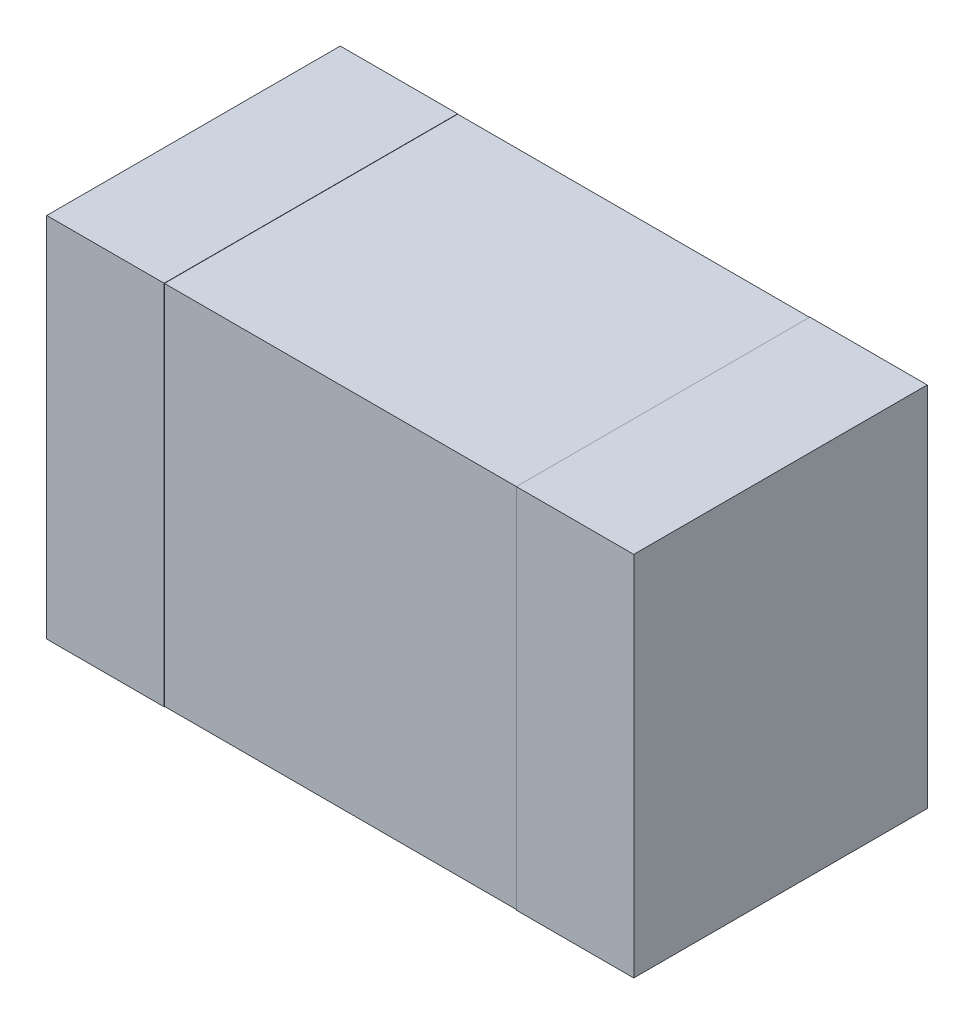
ISO-10303-21;
HEADER;
FILE_DESCRIPTION(('STEP AP214'),'2;1');
FILE_NAME('part.step','',(''),(''),'','','');
FILE_SCHEMA(('AUTOMOTIVE_DESIGN { 1 0 10303 214 1 1 1 1 }'));
ENDSEC;
DATA;
#1=APPLICATION_CONTEXT('core data for automotive mechanical design processes');
#2=APPLICATION_PROTOCOL_DEFINITION('international standard','automotive_design',2000,#1);
#3=PRODUCT_CONTEXT('',#1,'mechanical');
#4=PRODUCT('Part','Part','',(#3));
#5=PRODUCT_RELATED_PRODUCT_CATEGORY('part','',(#4));
#6=PRODUCT_DEFINITION_FORMATION('','',#4);
#7=PRODUCT_DEFINITION_CONTEXT('part definition',#1,'design');
#8=PRODUCT_DEFINITION('design','',#6,#7);
#9=PRODUCT_DEFINITION_SHAPE('','',#8);
#10=(LENGTH_UNIT() NAMED_UNIT(*) SI_UNIT(.MILLI.,.METRE.));
#11=(NAMED_UNIT(*) PLANE_ANGLE_UNIT() SI_UNIT($,.RADIAN.));
#12=(NAMED_UNIT(*) SI_UNIT($,.STERADIAN.) SOLID_ANGLE_UNIT());
#13=UNCERTAINTY_MEASURE_WITH_UNIT(LENGTH_MEASURE(1.E-05),#10,'distance_accuracy_value','');
#14=(GEOMETRIC_REPRESENTATION_CONTEXT(3) GLOBAL_UNCERTAINTY_ASSIGNED_CONTEXT((#13)) GLOBAL_UNIT_ASSIGNED_CONTEXT((#10,
#11,#12)) REPRESENTATION_CONTEXT('',''));
#15=CARTESIAN_POINT('',(0.,0.,0.));
#16=DIRECTION('',(0.,0.,1.));
#17=DIRECTION('',(1.,0.,0.));
#18=AXIS2_PLACEMENT_3D('',#15,#16,#17);
#19=CARTESIAN_POINT('',(0.,0.,1.));
#20=DIRECTION('',(0.,0.,1.));
#21=DIRECTION('',(1.,0.,0.));
#22=AXIS2_PLACEMENT_3D('',#19,#20,#21);
#23=PLANE('',#22);
#24=DIRECTION('',(1.,0.,0.));
#25=VECTOR('',#24,1.);
#26=CARTESIAN_POINT('',(-1.,-0.625,1.));
#27=LINE('',#26,#25);
#28=CARTESIAN_POINT('',(-1.,-0.625,1.));
#29=VERTEX_POINT('',#28);
#30=CARTESIAN_POINT('',(-0.6,-0.625,1.));
#31=VERTEX_POINT('',#30);
#32=EDGE_CURVE('E11',#29,#31,#27,.T.);
#33=ORIENTED_EDGE('',*,*,#32,.T.);
#34=DIRECTION('',(0.,1.,0.));
#35=VECTOR('',#34,1.);
#36=CARTESIAN_POINT('',(-0.6,0.625,1.));
#37=LINE('',#36,#35);
#38=CARTESIAN_POINT('',(-0.6,0.625,1.));
#39=VERTEX_POINT('',#38);
#40=EDGE_CURVE('E149',#31,#39,#37,.T.);
#41=ORIENTED_EDGE('',*,*,#40,.T.);
#42=DIRECTION('',(-1.,0.,0.));
#43=VECTOR('',#42,1.);
#44=CARTESIAN_POINT('',(-1.,0.625,1.));
#45=LINE('',#44,#43);
#46=CARTESIAN_POINT('',(-1.,0.625,1.));
#47=VERTEX_POINT('',#46);
#48=EDGE_CURVE('E26',#39,#47,#45,.T.);
#49=ORIENTED_EDGE('',*,*,#48,.T.);
#50=DIRECTION('',(0.,-1.,0.));
#51=VECTOR('',#50,1.);
#52=CARTESIAN_POINT('',(-1.,0.625,1.));
#53=LINE('',#52,#51);
#54=EDGE_CURVE('E167',#47,#29,#53,.T.);
#55=ORIENTED_EDGE('',*,*,#54,.T.);
#56=EDGE_LOOP('',(#33,#41,#49,#55));
#57=FACE_BOUND('',#56,.T.);
#58=ADVANCED_FACE('F16',(#57),#23,.T.);
#59=CARTESIAN_POINT('',(-1.,-0.625,1.));
#60=DIRECTION('',(0.,1.,0.));
#61=DIRECTION('',(1.,0.,0.));
#62=AXIS2_PLACEMENT_3D('',#59,#60,#61);
#63=PLANE('',#62);
#64=DIRECTION('',(1.,0.,0.));
#65=VECTOR('',#64,1.);
#66=CARTESIAN_POINT('',(-1.,-0.625,0.));
#67=LINE('',#66,#65);
#68=CARTESIAN_POINT('',(-1.,-0.625,0.));
#69=VERTEX_POINT('',#68);
#70=CARTESIAN_POINT('',(-0.6,-0.625,0.));
#71=VERTEX_POINT('',#70);
#72=EDGE_CURVE('E122',#69,#71,#67,.T.);
#73=ORIENTED_EDGE('',*,*,#72,.T.);
#74=DIRECTION('',(0.,0.,-1.));
#75=VECTOR('',#74,1.);
#76=CARTESIAN_POINT('',(-0.6,-0.625,1.));
#77=LINE('',#76,#75);
#78=EDGE_CURVE('E126',#31,#71,#77,.T.);
#79=ORIENTED_EDGE('',*,*,#78,.F.);
#80=ORIENTED_EDGE('',*,*,#32,.F.);
#81=DIRECTION('',(0.,0.,-1.));
#82=VECTOR('',#81,1.);
#83=CARTESIAN_POINT('',(-1.,-0.625,1.));
#84=LINE('',#83,#82);
#85=EDGE_CURVE('E129',#29,#69,#84,.T.);
#86=ORIENTED_EDGE('',*,*,#85,.T.);
#87=EDGE_LOOP('',(#73,#79,#80,#86));
#88=FACE_BOUND('',#87,.T.);
#89=ADVANCED_FACE('F124',(#88),#63,.F.);
#90=CARTESIAN_POINT('',(-1.,0.625,1.));
#91=DIRECTION('',(0.,-1.,0.));
#92=DIRECTION('',(0.,0.,-1.));
#93=AXIS2_PLACEMENT_3D('',#90,#91,#92);
#94=PLANE('',#93);
#95=ORIENTED_EDGE('',*,*,#48,.F.);
#96=DIRECTION('',(0.,0.,-1.));
#97=VECTOR('',#96,1.);
#98=CARTESIAN_POINT('',(-0.6,0.625,1.));
#99=LINE('',#98,#97);
#100=CARTESIAN_POINT('',(-0.6,0.625,0.));
#101=VERTEX_POINT('',#100);
#102=EDGE_CURVE('E157',#39,#101,#99,.T.);
#103=ORIENTED_EDGE('',*,*,#102,.T.);
#104=DIRECTION('',(-1.,0.,0.));
#105=VECTOR('',#104,1.);
#106=CARTESIAN_POINT('',(-1.,0.625,0.));
#107=LINE('',#106,#105);
#108=CARTESIAN_POINT('',(-1.,0.625,0.));
#109=VERTEX_POINT('',#108);
#110=EDGE_CURVE('E232',#101,#109,#107,.T.);
#111=ORIENTED_EDGE('',*,*,#110,.T.);
#112=DIRECTION('',(0.,0.,-1.));
#113=VECTOR('',#112,1.);
#114=CARTESIAN_POINT('',(-1.,0.625,1.));
#115=LINE('',#114,#113);
#116=EDGE_CURVE('E163',#47,#109,#115,.T.);
#117=ORIENTED_EDGE('',*,*,#116,.F.);
#118=EDGE_LOOP('',(#95,#103,#111,#117));
#119=FACE_BOUND('',#118,.T.);
#120=ADVANCED_FACE('F276',(#119),#94,.F.);
#121=CARTESIAN_POINT('',(1.,0.625,1.));
#122=DIRECTION('',(-1.,0.,0.));
#123=DIRECTION('',(0.,0.,1.));
#124=AXIS2_PLACEMENT_3D('',#121,#122,#123);
#125=PLANE('',#124);
#126=DIRECTION('',(0.,1.,0.));
#127=VECTOR('',#126,1.);
#128=CARTESIAN_POINT('',(1.,0.625,0.));
#129=LINE('',#128,#127);
#130=CARTESIAN_POINT('',(1.,-0.625,0.));
#131=VERTEX_POINT('',#130);
#132=CARTESIAN_POINT('',(1.,0.625,0.));
#133=VERTEX_POINT('',#132);
#134=EDGE_CURVE('E190',#131,#133,#129,.T.);
#135=ORIENTED_EDGE('',*,*,#134,.T.);
#136=DIRECTION('',(0.,0.,-1.));
#137=VECTOR('',#136,1.);
#138=CARTESIAN_POINT('',(1.,0.625,1.));
#139=LINE('',#138,#137);
#140=CARTESIAN_POINT('',(1.,0.625,1.));
#141=VERTEX_POINT('',#140);
#142=EDGE_CURVE('E166',#141,#133,#139,.T.);
#143=ORIENTED_EDGE('',*,*,#142,.F.);
#144=DIRECTION('',(0.,1.,0.));
#145=VECTOR('',#144,1.);
#146=CARTESIAN_POINT('',(1.,0.625,1.));
#147=LINE('',#146,#145);
#148=CARTESIAN_POINT('',(1.,-0.625,1.));
#149=VERTEX_POINT('',#148);
#150=EDGE_CURVE('E171',#149,#141,#147,.T.);
#151=ORIENTED_EDGE('',*,*,#150,.F.);
#152=DIRECTION('',(0.,0.,-1.));
#153=VECTOR('',#152,1.);
#154=CARTESIAN_POINT('',(1.,-0.625,1.));
#155=LINE('',#154,#153);
#156=EDGE_CURVE('E240',#149,#131,#155,.T.);
#157=ORIENTED_EDGE('',*,*,#156,.T.);
#158=EDGE_LOOP('',(#135,#143,#151,#157));
#159=FACE_BOUND('',#158,.T.);
#160=ADVANCED_FACE('F408',(#159),#125,.F.);
#161=CARTESIAN_POINT('',(-1.,0.625,1.));
#162=DIRECTION('',(0.,-1.,0.));
#163=DIRECTION('',(0.,0.,-1.));
#164=AXIS2_PLACEMENT_3D('',#161,#162,#163);
#165=PLANE('',#164);
#166=DIRECTION('',(-1.,0.,0.));
#167=VECTOR('',#166,1.);
#168=CARTESIAN_POINT('',(-1.,0.625,0.));
#169=LINE('',#168,#167);
#170=CARTESIAN_POINT('',(0.6,0.625,0.));
#171=VERTEX_POINT('',#170);
#172=EDGE_CURVE('E229',#133,#171,#169,.T.);
#173=ORIENTED_EDGE('',*,*,#172,.T.);
#174=DIRECTION('',(0.,0.,-1.));
#175=VECTOR('',#174,1.);
#176=CARTESIAN_POINT('',(0.6,0.625,1.));
#177=LINE('',#176,#175);
#178=CARTESIAN_POINT('',(0.6,0.625,1.));
#179=VERTEX_POINT('',#178);
#180=EDGE_CURVE('E225',#179,#171,#177,.T.);
#181=ORIENTED_EDGE('',*,*,#180,.F.);
#182=DIRECTION('',(-1.,0.,0.));
#183=VECTOR('',#182,1.);
#184=CARTESIAN_POINT('',(-1.,0.625,1.));
#185=LINE('',#184,#183);
#186=EDGE_CURVE('E239',#141,#179,#185,.T.);
#187=ORIENTED_EDGE('',*,*,#186,.F.);
#188=ORIENTED_EDGE('',*,*,#142,.T.);
#189=EDGE_LOOP('',(#173,#181,#187,#188));
#190=FACE_BOUND('',#189,.T.);
#191=ADVANCED_FACE('F404',(#190),#165,.F.);
#192=CARTESIAN_POINT('',(-1.,0.625,1.));
#193=DIRECTION('',(1.,0.,0.));
#194=DIRECTION('',(0.,1.,0.));
#195=AXIS2_PLACEMENT_3D('',#192,#193,#194);
#196=PLANE('',#195);
#197=DIRECTION('',(0.,-1.,0.));
#198=VECTOR('',#197,1.);
#199=CARTESIAN_POINT('',(-1.,0.625,0.));
#200=LINE('',#199,#198);
#201=EDGE_CURVE('E134',#109,#69,#200,.T.);
#202=ORIENTED_EDGE('',*,*,#201,.T.);
#203=ORIENTED_EDGE('',*,*,#85,.F.);
#204=ORIENTED_EDGE('',*,*,#54,.F.);
#205=ORIENTED_EDGE('',*,*,#116,.T.);
#206=EDGE_LOOP('',(#202,#203,#204,#205));
#207=FACE_BOUND('',#206,.T.);
#208=ADVANCED_FACE('F279',(#207),#196,.F.);
#209=CARTESIAN_POINT('',(-1.,-0.625,1.));
#210=DIRECTION('',(0.,1.,0.));
#211=DIRECTION('',(1.,0.,0.));
#212=AXIS2_PLACEMENT_3D('',#209,#210,#211);
#213=PLANE('',#212);
#214=DIRECTION('',(1.,0.,0.));
#215=VECTOR('',#214,1.);
#216=CARTESIAN_POINT('',(-1.,-0.625,1.));
#217=LINE('',#216,#215);
#218=CARTESIAN_POINT('',(0.6,-0.625,1.));
#219=VERTEX_POINT('',#218);
#220=EDGE_CURVE('E168',#219,#149,#217,.T.);
#221=ORIENTED_EDGE('',*,*,#220,.F.);
#222=DIRECTION('',(0.,0.,-1.));
#223=VECTOR('',#222,1.);
#224=CARTESIAN_POINT('',(0.6,-0.625,1.));
#225=LINE('',#224,#223);
#226=CARTESIAN_POINT('',(0.6,-0.625,0.));
#227=VERTEX_POINT('',#226);
#228=EDGE_CURVE('E195',#219,#227,#225,.T.);
#229=ORIENTED_EDGE('',*,*,#228,.T.);
#230=DIRECTION('',(1.,0.,0.));
#231=VECTOR('',#230,1.);
#232=CARTESIAN_POINT('',(-1.,-0.625,0.));
#233=LINE('',#232,#231);
#234=EDGE_CURVE('E172',#227,#131,#233,.T.);
#235=ORIENTED_EDGE('',*,*,#234,.T.);
#236=ORIENTED_EDGE('',*,*,#156,.F.);
#237=EDGE_LOOP('',(#221,#229,#235,#236));
#238=FACE_BOUND('',#237,.T.);
#239=ADVANCED_FACE('F456',(#238),#213,.F.);
#240=CARTESIAN_POINT('',(0.,0.,1.));
#241=DIRECTION('',(0.,0.,1.));
#242=DIRECTION('',(1.,0.,0.));
#243=AXIS2_PLACEMENT_3D('',#240,#241,#242);
#244=PLANE('',#243);
#245=DIRECTION('',(0.,-1.,0.));
#246=VECTOR('',#245,1.);
#247=CARTESIAN_POINT('',(0.6,0.625,1.));
#248=LINE('',#247,#246);
#249=EDGE_CURVE('E213',#179,#219,#248,.T.);
#250=ORIENTED_EDGE('',*,*,#249,.T.);
#251=ORIENTED_EDGE('',*,*,#220,.T.);
#252=ORIENTED_EDGE('',*,*,#150,.T.);
#253=ORIENTED_EDGE('',*,*,#186,.T.);
#254=EDGE_LOOP('',(#250,#251,#252,#253));
#255=FACE_BOUND('',#254,.T.);
#256=ADVANCED_FACE('F464',(#255),#244,.T.);
#257=CARTESIAN_POINT('',(0.,0.,0.));
#258=DIRECTION('',(0.,0.,1.));
#259=DIRECTION('',(1.,0.,0.));
#260=AXIS2_PLACEMENT_3D('',#257,#258,#259);
#261=PLANE('',#260);
#262=DIRECTION('',(1.,0.,0.));
#263=VECTOR('',#262,1.);
#264=CARTESIAN_POINT('',(0.6,-0.624,0.));
#265=LINE('',#264,#263);
#266=CARTESIAN_POINT('',(-0.6,-0.624,0.));
#267=VERTEX_POINT('',#266);
#268=CARTESIAN_POINT('',(0.6,-0.624,0.));
#269=VERTEX_POINT('',#268);
#270=EDGE_CURVE('E140',#267,#269,#265,.T.);
#271=ORIENTED_EDGE('',*,*,#270,.F.);
#272=DIRECTION('',(-2.168404344971E-13,1.,0.));
#273=VECTOR('',#272,1.);
#274=CARTESIAN_POINT('',(-0.6,-0.624,0.));
#275=LINE('',#274,#273);
#276=EDGE_CURVE('E135',#71,#267,#275,.T.);
#277=ORIENTED_EDGE('',*,*,#276,.F.);
#278=ORIENTED_EDGE('',*,*,#72,.F.);
#279=ORIENTED_EDGE('',*,*,#201,.F.);
#280=ORIENTED_EDGE('',*,*,#110,.F.);
#281=DIRECTION('',(0.,1.,0.));
#282=VECTOR('',#281,1.);
#283=CARTESIAN_POINT('',(-0.6,0.625,0.));
#284=LINE('',#283,#282);
#285=CARTESIAN_POINT('',(-0.6,0.624,0.));
#286=VERTEX_POINT('',#285);
#287=EDGE_CURVE('E201',#286,#101,#284,.T.);
#288=ORIENTED_EDGE('',*,*,#287,.F.);
#289=DIRECTION('',(-1.,0.,0.));
#290=VECTOR('',#289,1.);
#291=CARTESIAN_POINT('',(0.6,0.624,0.));
#292=LINE('',#291,#290);
#293=CARTESIAN_POINT('',(0.6,0.624,0.));
#294=VERTEX_POINT('',#293);
#295=EDGE_CURVE('E204',#294,#286,#292,.T.);
#296=ORIENTED_EDGE('',*,*,#295,.F.);
#297=DIRECTION('',(0.,-1.,0.));
#298=VECTOR('',#297,1.);
#299=CARTESIAN_POINT('',(0.6,0.625,0.));
#300=LINE('',#299,#298);
#301=EDGE_CURVE('E19',#171,#294,#300,.T.);
#302=ORIENTED_EDGE('',*,*,#301,.F.);
#303=ORIENTED_EDGE('',*,*,#172,.F.);
#304=ORIENTED_EDGE('',*,*,#134,.F.);
#305=ORIENTED_EDGE('',*,*,#234,.F.);
#306=DIRECTION('',(2.168404344971E-13,-1.,0.));
#307=VECTOR('',#306,1.);
#308=CARTESIAN_POINT('',(0.6,-0.624,0.));
#309=LINE('',#308,#307);
#310=EDGE_CURVE('E191',#269,#227,#309,.T.);
#311=ORIENTED_EDGE('',*,*,#310,.F.);
#312=EDGE_LOOP('',(#271,#277,#278,#279,#280,#288,#296,#302,#303,#304,#305,#311));
#313=FACE_BOUND('',#312,.T.);
#314=ADVANCED_FACE('F138',(#313),#261,.F.);
#315=CARTESIAN_POINT('',(-0.6,0.625,1.));
#316=DIRECTION('',(-1.,0.,0.));
#317=DIRECTION('',(0.,0.,1.));
#318=AXIS2_PLACEMENT_3D('',#315,#316,#317);
#319=PLANE('',#318);
#320=ORIENTED_EDGE('',*,*,#287,.T.);
#321=ORIENTED_EDGE('',*,*,#102,.F.);
#322=ORIENTED_EDGE('',*,*,#40,.F.);
#323=ORIENTED_EDGE('',*,*,#78,.T.);
#324=ORIENTED_EDGE('',*,*,#276,.T.);
#325=DIRECTION('',(0.,0.,-1.));
#326=VECTOR('',#325,1.);
#327=CARTESIAN_POINT('',(-0.6,-0.624,1.));
#328=LINE('',#327,#326);
#329=CARTESIAN_POINT('',(-0.6,-0.624,0.999));
#330=VERTEX_POINT('',#329);
#331=EDGE_CURVE('E183',#330,#267,#328,.T.);
#332=ORIENTED_EDGE('',*,*,#331,.F.);
#333=DIRECTION('',(0.,1.,0.));
#334=VECTOR('',#333,1.);
#335=CARTESIAN_POINT('',(-0.6,-0.625,0.999));
#336=LINE('',#335,#334);
#337=CARTESIAN_POINT('',(-0.6,0.624,0.999));
#338=VERTEX_POINT('',#337);
#339=EDGE_CURVE('E174',#330,#338,#336,.T.);
#340=ORIENTED_EDGE('',*,*,#339,.T.);
#341=DIRECTION('',(0.,0.,-1.));
#342=VECTOR('',#341,1.);
#343=CARTESIAN_POINT('',(-0.6,0.624,1.));
#344=LINE('',#343,#342);
#345=EDGE_CURVE('E161',#338,#286,#344,.T.);
#346=ORIENTED_EDGE('',*,*,#345,.T.);
#347=EDGE_LOOP('',(#320,#321,#322,#323,#324,#332,#340,#346));
#348=FACE_BOUND('',#347,.T.);
#349=ADVANCED_FACE('F147',(#348),#319,.F.);
#350=CARTESIAN_POINT('',(0.6,0.624,1.));
#351=DIRECTION('',(0.,-1.,0.));
#352=DIRECTION('',(0.,0.,-1.));
#353=AXIS2_PLACEMENT_3D('',#350,#351,#352);
#354=PLANE('',#353);
#355=ORIENTED_EDGE('',*,*,#345,.F.);
#356=DIRECTION('',(-1.,0.,0.));
#357=VECTOR('',#356,1.);
#358=CARTESIAN_POINT('',(0.6,0.624,0.999));
#359=LINE('',#358,#357);
#360=CARTESIAN_POINT('',(0.6,0.624,0.999));
#361=VERTEX_POINT('',#360);
#362=EDGE_CURVE('E179',#361,#338,#359,.T.);
#363=ORIENTED_EDGE('',*,*,#362,.F.);
#364=DIRECTION('',(0.,0.,-1.));
#365=VECTOR('',#364,1.);
#366=CARTESIAN_POINT('',(0.6,0.624,1.));
#367=LINE('',#366,#365);
#368=EDGE_CURVE('E196',#361,#294,#367,.T.);
#369=ORIENTED_EDGE('',*,*,#368,.T.);
#370=ORIENTED_EDGE('',*,*,#295,.T.);
#371=EDGE_LOOP('',(#355,#363,#369,#370));
#372=FACE_BOUND('',#371,.T.);
#373=ADVANCED_FACE('F272',(#372),#354,.F.);
#374=CARTESIAN_POINT('',(0.6,0.625,1.));
#375=DIRECTION('',(1.,0.,0.));
#376=DIRECTION('',(0.,1.,0.));
#377=AXIS2_PLACEMENT_3D('',#374,#375,#376);
#378=PLANE('',#377);
#379=ORIENTED_EDGE('',*,*,#301,.T.);
#380=ORIENTED_EDGE('',*,*,#368,.F.);
#381=DIRECTION('',(0.,1.,0.));
#382=VECTOR('',#381,1.);
#383=CARTESIAN_POINT('',(0.6,-0.625,0.999));
#384=LINE('',#383,#382);
#385=CARTESIAN_POINT('',(0.6,-0.624,0.999));
#386=VERTEX_POINT('',#385);
#387=EDGE_CURVE('E197',#386,#361,#384,.T.);
#388=ORIENTED_EDGE('',*,*,#387,.F.);
#389=DIRECTION('',(0.,0.,-1.));
#390=VECTOR('',#389,1.);
#391=CARTESIAN_POINT('',(0.6,-0.624,1.));
#392=LINE('',#391,#390);
#393=EDGE_CURVE('E180',#386,#269,#392,.T.);
#394=ORIENTED_EDGE('',*,*,#393,.T.);
#395=ORIENTED_EDGE('',*,*,#310,.T.);
#396=ORIENTED_EDGE('',*,*,#228,.F.);
#397=ORIENTED_EDGE('',*,*,#249,.F.);
#398=ORIENTED_EDGE('',*,*,#180,.T.);
#399=EDGE_LOOP('',(#379,#380,#388,#394,#395,#396,#397,#398));
#400=FACE_BOUND('',#399,.T.);
#401=ADVANCED_FACE('F433',(#400),#378,.F.);
#402=CARTESIAN_POINT('',(0.6,-0.624,1.));
#403=DIRECTION('',(0.,1.,0.));
#404=DIRECTION('',(1.,0.,0.));
#405=AXIS2_PLACEMENT_3D('',#402,#403,#404);
#406=PLANE('',#405);
#407=ORIENTED_EDGE('',*,*,#393,.F.);
#408=DIRECTION('',(-1.,0.,0.));
#409=VECTOR('',#408,1.);
#410=CARTESIAN_POINT('',(0.6,-0.624,0.999));
#411=LINE('',#410,#409);
#412=EDGE_CURVE('E178',#386,#330,#411,.T.);
#413=ORIENTED_EDGE('',*,*,#412,.T.);
#414=ORIENTED_EDGE('',*,*,#331,.T.);
#415=ORIENTED_EDGE('',*,*,#270,.T.);
#416=EDGE_LOOP('',(#407,#413,#414,#415));
#417=FACE_BOUND('',#416,.T.);
#418=ADVANCED_FACE('F417',(#417),#406,.F.);
#419=CARTESIAN_POINT('',(0.6,-0.625,0.999));
#420=DIRECTION('',(0.,0.,-1.));
#421=DIRECTION('',(0.,-1.,0.));
#422=AXIS2_PLACEMENT_3D('',#419,#420,#421);
#423=PLANE('',#422);
#424=ORIENTED_EDGE('',*,*,#387,.T.);
#425=ORIENTED_EDGE('',*,*,#362,.T.);
#426=ORIENTED_EDGE('',*,*,#339,.F.);
#427=ORIENTED_EDGE('',*,*,#412,.F.);
#428=EDGE_LOOP('',(#424,#425,#426,#427));
#429=FACE_BOUND('',#428,.T.);
#430=ADVANCED_FACE('F413',(#429),#423,.F.);
#431=CLOSED_SHELL('',(#58,#89,#120,#160,#191,#208,#239,#256,#314,#349,#373,#401,#418,#430));
#432=MANIFOLD_SOLID_BREP('B1',#431);
#433=ADVANCED_BREP_SHAPE_REPRESENTATION('',(#18,#432),#14);
#434=SHAPE_DEFINITION_REPRESENTATION(#9,#433);
ENDSEC;
END-ISO-10303-21;
